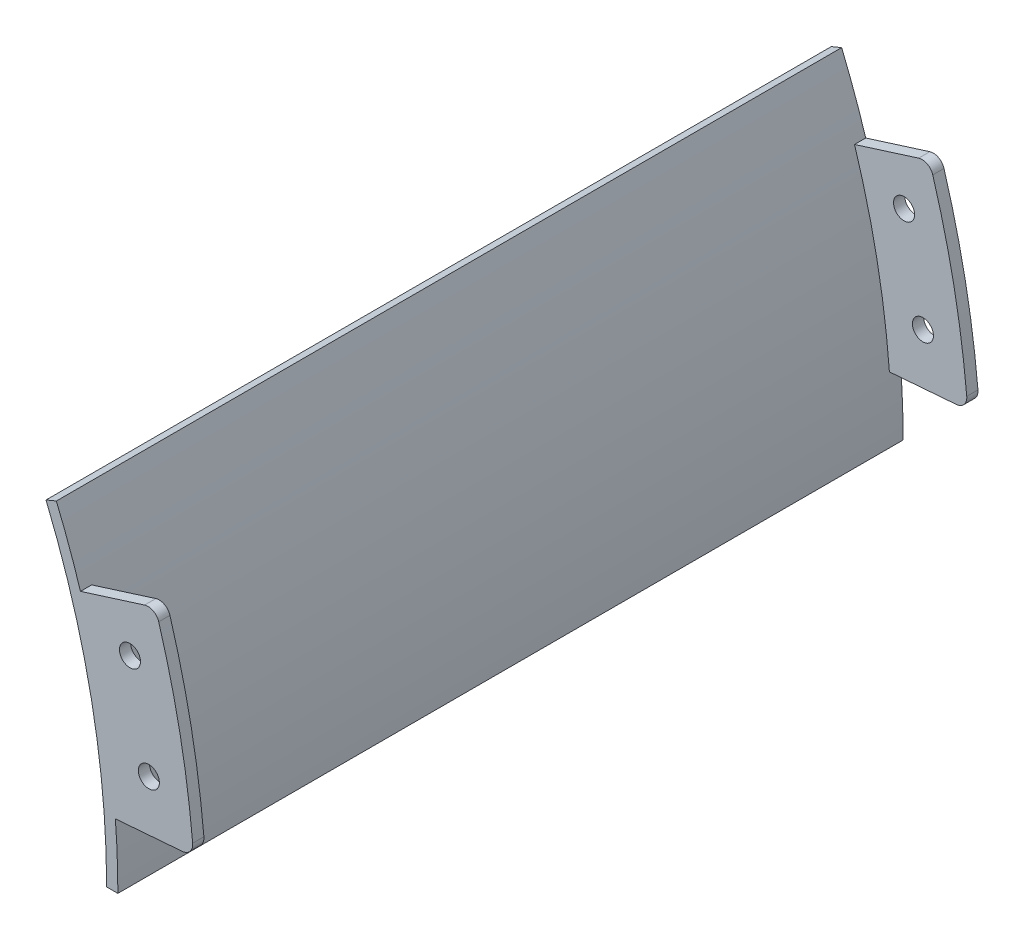
ISO-10303-21;
HEADER;
FILE_DESCRIPTION(('STEP AP214'),'2;1');
FILE_NAME('part.step','',(''),(''),'','','');
FILE_SCHEMA(('AUTOMOTIVE_DESIGN { 1 0 10303 214 1 1 1 1 }'));
ENDSEC;
DATA;
#1=APPLICATION_CONTEXT('core data for automotive mechanical design processes');
#2=APPLICATION_PROTOCOL_DEFINITION('international standard','automotive_design',2000,#1);
#3=PRODUCT_CONTEXT('',#1,'mechanical');
#4=PRODUCT('Part','Part','',(#3));
#5=PRODUCT_RELATED_PRODUCT_CATEGORY('part','',(#4));
#6=PRODUCT_DEFINITION_FORMATION('','',#4);
#7=PRODUCT_DEFINITION_CONTEXT('part definition',#1,'design');
#8=PRODUCT_DEFINITION('design','',#6,#7);
#9=PRODUCT_DEFINITION_SHAPE('','',#8);
#10=(LENGTH_UNIT() NAMED_UNIT(*) SI_UNIT(.MILLI.,.METRE.));
#11=(NAMED_UNIT(*) PLANE_ANGLE_UNIT() SI_UNIT($,.RADIAN.));
#12=(NAMED_UNIT(*) SI_UNIT($,.STERADIAN.) SOLID_ANGLE_UNIT());
#13=UNCERTAINTY_MEASURE_WITH_UNIT(LENGTH_MEASURE(1.E-05),#10,'distance_accuracy_value','');
#14=(GEOMETRIC_REPRESENTATION_CONTEXT(3) GLOBAL_UNCERTAINTY_ASSIGNED_CONTEXT((#13)) GLOBAL_UNIT_ASSIGNED_CONTEXT((#10,
#11,#12)) REPRESENTATION_CONTEXT('',''));
#15=CARTESIAN_POINT('',(0.,0.,0.));
#16=DIRECTION('',(0.,0.,1.));
#17=DIRECTION('',(1.,0.,0.));
#18=AXIS2_PLACEMENT_3D('',#15,#16,#17);
#19=CARTESIAN_POINT('',(0.,0.,177.8));
#20=DIRECTION('',(0.,0.,-1.));
#21=DIRECTION('',(-1.,0.,0.));
#22=AXIS2_PLACEMENT_3D('',#19,#20,#21);
#23=CYLINDRICAL_SURFACE('',#22,182.88);
#24=DIRECTION('',(0.,0.,-1.));
#25=VECTOR('',#24,1.);
#26=CARTESIAN_POINT('',(182.316241993114,14.3485994267075,2.54));
#27=LINE('',#26,#25);
#28=CARTESIAN_POINT('',(182.316241993114,14.3485994267075,2.53999999999999));
#29=VERTEX_POINT('',#28);
#30=CARTESIAN_POINT('',(182.316241993114,14.3485994267075,0.));
#31=VERTEX_POINT('',#30);
#32=EDGE_CURVE('E61',#29,#31,#27,.T.);
#33=ORIENTED_EDGE('',*,*,#32,.F.);
#34=CARTESIAN_POINT('',(0.,0.,2.54));
#35=DIRECTION('',(0.,0.,-1.));
#36=DIRECTION('',(-1.,0.,0.));
#37=AXIS2_PLACEMENT_3D('',#34,#35,#36);
#38=CIRCLE('',#37,182.88);
#39=CARTESIAN_POINT('',(174.415755952836,54.9930766133408,2.53999999999999));
#40=VERTEX_POINT('',#39);
#41=EDGE_CURVE('E66',#40,#29,#38,.T.);
#42=ORIENTED_EDGE('',*,*,#41,.F.);
#43=DIRECTION('',(0.,0.,-1.));
#44=VECTOR('',#43,1.);
#45=CARTESIAN_POINT('',(174.415755952836,54.9930766133408,2.54));
#46=LINE('',#45,#44);
#47=CARTESIAN_POINT('',(174.415755952836,54.9930766133408,0.));
#48=VERTEX_POINT('',#47);
#49=EDGE_CURVE('E182',#40,#48,#46,.T.);
#50=ORIENTED_EDGE('',*,*,#49,.T.);
#51=CARTESIAN_POINT('',(0.,0.,0.));
#52=DIRECTION('',(0.,0.,1.));
#53=DIRECTION('',(-1.,0.,0.));
#54=AXIS2_PLACEMENT_3D('',#51,#52,#53);
#55=CIRCLE('',#54,182.88);
#56=CARTESIAN_POINT('',(168.959088905665,69.9851461109266,0.));
#57=VERTEX_POINT('',#56);
#58=EDGE_CURVE('E331',#48,#57,#55,.T.);
#59=ORIENTED_EDGE('',*,*,#58,.T.);
#60=DIRECTION('',(0.,0.,-1.));
#61=VECTOR('',#60,1.);
#62=CARTESIAN_POINT('',(168.959088905665,69.9851461109266,177.8));
#63=LINE('',#62,#61);
#64=CARTESIAN_POINT('',(168.959088905665,69.9851461109266,177.8));
#65=VERTEX_POINT('',#64);
#66=EDGE_CURVE('E340',#65,#57,#63,.T.);
#67=ORIENTED_EDGE('',*,*,#66,.F.);
#68=CARTESIAN_POINT('',(0.,0.,177.8));
#69=DIRECTION('',(0.,0.,1.));
#70=DIRECTION('',(-1.,0.,0.));
#71=AXIS2_PLACEMENT_3D('',#68,#69,#70);
#72=CIRCLE('',#71,182.88);
#73=CARTESIAN_POINT('',(174.415755952836,54.9930766133408,177.8));
#74=VERTEX_POINT('',#73);
#75=EDGE_CURVE('E316',#74,#65,#72,.T.);
#76=ORIENTED_EDGE('',*,*,#75,.F.);
#77=DIRECTION('',(0.,0.,1.));
#78=VECTOR('',#77,1.);
#79=CARTESIAN_POINT('',(174.415755952836,54.9930766133408,175.26));
#80=LINE('',#79,#78);
#81=CARTESIAN_POINT('',(174.415755952836,54.9930766133408,175.26));
#82=VERTEX_POINT('',#81);
#83=EDGE_CURVE('E288',#82,#74,#80,.T.);
#84=ORIENTED_EDGE('',*,*,#83,.F.);
#85=CARTESIAN_POINT('',(0.,0.,175.26));
#86=DIRECTION('',(0.,0.,-1.));
#87=DIRECTION('',(-1.,0.,0.));
#88=AXIS2_PLACEMENT_3D('',#85,#86,#87);
#89=CIRCLE('',#88,182.88);
#90=CARTESIAN_POINT('',(182.316241993114,14.3485994267075,175.26));
#91=VERTEX_POINT('',#90);
#92=EDGE_CURVE('E245',#82,#91,#89,.T.);
#93=ORIENTED_EDGE('',*,*,#92,.T.);
#94=DIRECTION('',(0.,0.,1.));
#95=VECTOR('',#94,1.);
#96=CARTESIAN_POINT('',(182.316241993114,14.3485994267075,175.26));
#97=LINE('',#96,#95);
#98=CARTESIAN_POINT('',(182.316241993114,14.3485994267075,177.8));
#99=VERTEX_POINT('',#98);
#100=EDGE_CURVE('E270',#91,#99,#97,.T.);
#101=ORIENTED_EDGE('',*,*,#100,.T.);
#102=CARTESIAN_POINT('',(182.88,0.,177.8));
#103=VERTEX_POINT('',#102);
#104=EDGE_CURVE('E317',#103,#99,#72,.T.);
#105=ORIENTED_EDGE('',*,*,#104,.F.);
#106=DIRECTION('',(0.,0.,-1.));
#107=VECTOR('',#106,1.);
#108=CARTESIAN_POINT('',(182.88,0.,177.8));
#109=LINE('',#108,#107);
#110=CARTESIAN_POINT('',(182.88,0.,0.));
#111=VERTEX_POINT('',#110);
#112=EDGE_CURVE('E54',#103,#111,#109,.T.);
#113=ORIENTED_EDGE('',*,*,#112,.T.);
#114=EDGE_CURVE('E332',#111,#31,#55,.T.);
#115=ORIENTED_EDGE('',*,*,#114,.T.);
#116=EDGE_LOOP('',(#33,#42,#50,#59,#67,#76,#84,#93,#101,#105,#113,#115));
#117=FACE_BOUND('',#116,.T.);
#118=ADVANCED_FACE('F45',(#117),#23,.T.);
#119=CARTESIAN_POINT('',(0.,0.,177.8));
#120=DIRECTION('',(0.,0.,-1.));
#121=DIRECTION('',(-1.,0.,0.));
#122=AXIS2_PLACEMENT_3D('',#119,#120,#121);
#123=CYLINDRICAL_SURFACE('',#122,180.34);
#124=CARTESIAN_POINT('',(0.,0.,0.));
#125=DIRECTION('',(0.,0.,-1.));
#126=DIRECTION('',(-1.,0.,0.));
#127=AXIS2_PLACEMENT_3D('',#124,#125,#126);
#128=CIRCLE('',#127,180.34);
#129=CARTESIAN_POINT('',(166.612434893086,69.0131301927193,0.));
#130=VERTEX_POINT('',#129);
#131=CARTESIAN_POINT('',(180.34,0.,0.));
#132=VERTEX_POINT('',#131);
#133=EDGE_CURVE('E292',#130,#132,#128,.T.);
#134=ORIENTED_EDGE('',*,*,#133,.T.);
#135=DIRECTION('',(0.,0.,-1.));
#136=VECTOR('',#135,1.);
#137=CARTESIAN_POINT('',(180.34,0.,177.8));
#138=LINE('',#137,#136);
#139=CARTESIAN_POINT('',(180.34,0.,177.8));
#140=VERTEX_POINT('',#139);
#141=EDGE_CURVE('E11',#140,#132,#138,.T.);
#142=ORIENTED_EDGE('',*,*,#141,.F.);
#143=CARTESIAN_POINT('',(0.,0.,177.8));
#144=DIRECTION('',(0.,0.,-1.));
#145=DIRECTION('',(-1.,0.,0.));
#146=AXIS2_PLACEMENT_3D('',#143,#144,#145);
#147=CIRCLE('',#146,180.34);
#148=CARTESIAN_POINT('',(166.612434893086,69.0131301927193,177.8));
#149=VERTEX_POINT('',#148);
#150=EDGE_CURVE('E308',#149,#140,#147,.T.);
#151=ORIENTED_EDGE('',*,*,#150,.F.);
#152=DIRECTION('',(0.,0.,-1.));
#153=VECTOR('',#152,1.);
#154=CARTESIAN_POINT('',(166.612434893086,69.0131301927193,177.8));
#155=LINE('',#154,#153);
#156=EDGE_CURVE('E324',#149,#130,#155,.T.);
#157=ORIENTED_EDGE('',*,*,#156,.T.);
#158=EDGE_LOOP('',(#134,#142,#151,#157));
#159=FACE_BOUND('',#158,.T.);
#160=ADVANCED_FACE('F47',(#159),#123,.F.);
#161=CARTESIAN_POINT('',(182.88,0.,177.8));
#162=DIRECTION('',(0.,1.,0.));
#163=DIRECTION('',(-1.,0.,0.));
#164=AXIS2_PLACEMENT_3D('',#161,#162,#163);
#165=PLANE('',#164);
#166=DIRECTION('',(1.,0.,0.));
#167=VECTOR('',#166,1.);
#168=CARTESIAN_POINT('',(182.88,0.,0.));
#169=LINE('',#168,#167);
#170=EDGE_CURVE('E328',#132,#111,#169,.T.);
#171=ORIENTED_EDGE('',*,*,#170,.T.);
#172=ORIENTED_EDGE('',*,*,#112,.F.);
#173=DIRECTION('',(1.,0.,0.));
#174=VECTOR('',#173,1.);
#175=CARTESIAN_POINT('',(182.88,0.,177.8));
#176=LINE('',#175,#174);
#177=EDGE_CURVE('E312',#140,#103,#176,.T.);
#178=ORIENTED_EDGE('',*,*,#177,.F.);
#179=ORIENTED_EDGE('',*,*,#141,.T.);
#180=EDGE_LOOP('',(#171,#172,#178,#179));
#181=FACE_BOUND('',#180,.T.);
#182=ADVANCED_FACE('F382',(#181),#165,.F.);
#183=CARTESIAN_POINT('',(166.612434893086,69.0131301927193,177.8));
#184=DIRECTION('',(0.38268343236508,-0.923879532511291,0.));
#185=DIRECTION('',(0.923879532511291,0.38268343236508,0.));
#186=AXIS2_PLACEMENT_3D('',#183,#184,#185);
#187=PLANE('',#186);
#188=DIRECTION('',(-0.923879532511291,-0.38268343236508,0.));
#189=VECTOR('',#188,1.);
#190=CARTESIAN_POINT('',(166.612434893086,69.0131301927193,0.));
#191=LINE('',#190,#189);
#192=EDGE_CURVE('E313',#57,#130,#191,.T.);
#193=ORIENTED_EDGE('',*,*,#192,.T.);
#194=ORIENTED_EDGE('',*,*,#156,.F.);
#195=DIRECTION('',(-0.923879532511291,-0.38268343236508,0.));
#196=VECTOR('',#195,1.);
#197=CARTESIAN_POINT('',(166.612434893086,69.0131301927193,177.8));
#198=LINE('',#197,#196);
#199=EDGE_CURVE('E321',#65,#149,#198,.T.);
#200=ORIENTED_EDGE('',*,*,#199,.F.);
#201=ORIENTED_EDGE('',*,*,#66,.T.);
#202=EDGE_LOOP('',(#193,#194,#200,#201));
#203=FACE_BOUND('',#202,.T.);
#204=ADVANCED_FACE('F378',(#203),#187,.F.);
#205=CARTESIAN_POINT('',(0.,0.,177.8));
#206=DIRECTION('',(0.,0.,-1.));
#207=DIRECTION('',(-1.,0.,0.));
#208=AXIS2_PLACEMENT_3D('',#205,#206,#207);
#209=PLANE('',#208);
#210=ORIENTED_EDGE('',*,*,#150,.T.);
#211=ORIENTED_EDGE('',*,*,#177,.T.);
#212=ORIENTED_EDGE('',*,*,#104,.T.);
#213=DIRECTION('',(0.996917333733128,0.0784590957278403,0.));
#214=VECTOR('',#213,1.);
#215=CARTESIAN_POINT('',(197.493029633011,15.5430385180821,177.8));
#216=LINE('',#215,#214);
#217=CARTESIAN_POINT('',(197.493029633011,15.5430385180821,177.8));
#218=VERTEX_POINT('',#217);
#219=EDGE_CURVE('E241',#99,#218,#216,.T.);
#220=ORIENTED_EDGE('',*,*,#219,.T.);
#221=CARTESIAN_POINT('',(197.293743529862,18.0752085457642,177.8));
#222=DIRECTION('',(0.,0.,1.));
#223=DIRECTION('',(-1.,0.,0.));
#224=AXIS2_PLACEMENT_3D('',#221,#222,#223);
#225=CIRCLE('',#224,2.54);
#226=CARTESIAN_POINT('',(199.823150498194,18.3069419886586,177.8));
#227=VERTEX_POINT('',#226);
#228=EDGE_CURVE('E274',#218,#227,#225,.T.);
#229=ORIENTED_EDGE('',*,*,#228,.T.);
#230=CARTESIAN_POINT('',(0.,0.,177.8));
#231=DIRECTION('',(0.,0.,1.));
#232=DIRECTION('',(-1.,0.,0.));
#233=AXIS2_PLACEMENT_3D('',#230,#231,#232);
#234=CIRCLE('',#233,200.66);
#235=CARTESIAN_POINT('',(192.130700084829,57.8811686553869,177.8));
#236=VERTEX_POINT('',#235);
#237=EDGE_CURVE('E278',#227,#236,#234,.T.);
#238=ORIENTED_EDGE('',*,*,#237,.T.);
#239=CARTESIAN_POINT('',(189.69866590654,57.1484956344327,177.8));
#240=DIRECTION('',(0.,0.,1.));
#241=DIRECTION('',(-1.,0.,0.));
#242=AXIS2_PLACEMENT_3D('',#239,#240,#241);
#243=CIRCLE('',#242,2.54000000000002);
#244=CARTESIAN_POINT('',(188.9348731758,59.5709366893332,177.8));
#245=VERTEX_POINT('',#244);
#246=EDGE_CURVE('E282',#236,#245,#243,.T.);
#247=ORIENTED_EDGE('',*,*,#246,.T.);
#248=DIRECTION('',(-0.953716950748228,-0.300705799504268,0.));
#249=VECTOR('',#248,1.);
#250=CARTESIAN_POINT('',(174.415755952836,54.9930766133408,177.8));
#251=LINE('',#250,#249);
#252=EDGE_CURVE('E250',#245,#74,#251,.T.);
#253=ORIENTED_EDGE('',*,*,#252,.T.);
#254=ORIENTED_EDGE('',*,*,#75,.T.);
#255=ORIENTED_EDGE('',*,*,#199,.T.);
#256=EDGE_LOOP('',(#210,#211,#212,#220,#229,#238,#247,#253,#254,#255));
#257=FACE_BOUND('',#256,.T.);
#258=CARTESIAN_POINT('',(189.904635813063,26.4111628010535,177.8));
#259=DIRECTION('',(0.,0.,1.));
#260=DIRECTION('',(1.,0.,0.));
#261=AXIS2_PLACEMENT_3D('',#258,#259,#260);
#262=CIRCLE('',#261,2.38125000000001);
#263=CARTESIAN_POINT('',(192.285885813063,26.4111628010535,177.8));
#264=VERTEX_POINT('',#263);
#265=EDGE_CURVE('E216',#264,#264,#262,.T.);
#266=ORIENTED_EDGE('',*,*,#265,.F.);
#267=EDGE_LOOP('',(#266));
#268=FACE_BOUND('',#267,.T.);
#269=CARTESIAN_POINT('',(185.626529875292,48.0011628010535,177.8));
#270=DIRECTION('',(0.,0.,1.));
#271=DIRECTION('',(1.,0.,0.));
#272=AXIS2_PLACEMENT_3D('',#269,#270,#271);
#273=CIRCLE('',#272,2.38125);
#274=CARTESIAN_POINT('',(188.007779875292,48.0011628010535,177.8));
#275=VERTEX_POINT('',#274);
#276=EDGE_CURVE('E233',#275,#275,#273,.T.);
#277=ORIENTED_EDGE('',*,*,#276,.F.);
#278=EDGE_LOOP('',(#277));
#279=FACE_BOUND('',#278,.T.);
#280=ADVANCED_FACE('F371',(#257,#268,#279),#209,.F.);
#281=CARTESIAN_POINT('',(0.,0.,0.));
#282=DIRECTION('',(0.,0.,-1.));
#283=DIRECTION('',(-1.,0.,0.));
#284=AXIS2_PLACEMENT_3D('',#281,#282,#283);
#285=PLANE('',#284);
#286=ORIENTED_EDGE('',*,*,#133,.F.);
#287=ORIENTED_EDGE('',*,*,#192,.F.);
#288=ORIENTED_EDGE('',*,*,#58,.F.);
#289=DIRECTION('',(-0.953716950748228,-0.300705799504268,0.));
#290=VECTOR('',#289,1.);
#291=CARTESIAN_POINT('',(174.415755952836,54.9930766133408,0.));
#292=LINE('',#291,#290);
#293=CARTESIAN_POINT('',(188.9348731758,59.5709366893332,0.));
#294=VERTEX_POINT('',#293);
#295=EDGE_CURVE('E200',#294,#48,#292,.T.);
#296=ORIENTED_EDGE('',*,*,#295,.F.);
#297=CARTESIAN_POINT('',(189.69866590654,57.1484956344327,0.));
#298=DIRECTION('',(0.,0.,1.));
#299=DIRECTION('',(-1.,0.,0.));
#300=AXIS2_PLACEMENT_3D('',#297,#298,#299);
#301=CIRCLE('',#300,2.54000000000002);
#302=CARTESIAN_POINT('',(192.130700084829,57.8811686553869,0.));
#303=VERTEX_POINT('',#302);
#304=EDGE_CURVE('E176',#303,#294,#301,.T.);
#305=ORIENTED_EDGE('',*,*,#304,.F.);
#306=CARTESIAN_POINT('',(0.,0.,0.));
#307=DIRECTION('',(0.,0.,1.));
#308=DIRECTION('',(-1.,0.,0.));
#309=AXIS2_PLACEMENT_3D('',#306,#307,#308);
#310=CIRCLE('',#309,200.66);
#311=CARTESIAN_POINT('',(199.823150498194,18.3069419886586,0.));
#312=VERTEX_POINT('',#311);
#313=EDGE_CURVE('E206',#312,#303,#310,.T.);
#314=ORIENTED_EDGE('',*,*,#313,.F.);
#315=CARTESIAN_POINT('',(197.293743529862,18.0752085457642,0.));
#316=DIRECTION('',(0.,0.,1.));
#317=DIRECTION('',(-1.,0.,0.));
#318=AXIS2_PLACEMENT_3D('',#315,#316,#317);
#319=CIRCLE('',#318,2.54);
#320=CARTESIAN_POINT('',(197.493029633011,15.5430385180821,0.));
#321=VERTEX_POINT('',#320);
#322=EDGE_CURVE('E209',#321,#312,#319,.T.);
#323=ORIENTED_EDGE('',*,*,#322,.F.);
#324=DIRECTION('',(0.996917333733128,0.0784590957278403,0.));
#325=VECTOR('',#324,1.);
#326=CARTESIAN_POINT('',(197.493029633011,15.5430385180821,0.));
#327=LINE('',#326,#325);
#328=EDGE_CURVE('E188',#31,#321,#327,.T.);
#329=ORIENTED_EDGE('',*,*,#328,.F.);
#330=ORIENTED_EDGE('',*,*,#114,.F.);
#331=ORIENTED_EDGE('',*,*,#170,.F.);
#332=EDGE_LOOP('',(#286,#287,#288,#296,#305,#314,#323,#329,#330,#331));
#333=FACE_BOUND('',#332,.T.);
#334=CARTESIAN_POINT('',(185.626529875292,48.0011628010535,0.));
#335=DIRECTION('',(0.,0.,1.));
#336=DIRECTION('',(1.,0.,0.));
#337=AXIS2_PLACEMENT_3D('',#334,#335,#336);
#338=CIRCLE('',#337,2.38125);
#339=CARTESIAN_POINT('',(188.007779875292,48.0011628010535,0.));
#340=VERTEX_POINT('',#339);
#341=EDGE_CURVE('E463',#340,#340,#338,.T.);
#342=ORIENTED_EDGE('',*,*,#341,.T.);
#343=EDGE_LOOP('',(#342));
#344=FACE_BOUND('',#343,.T.);
#345=CARTESIAN_POINT('',(189.904635813063,26.4111628010535,0.));
#346=DIRECTION('',(0.,0.,1.));
#347=DIRECTION('',(1.,0.,0.));
#348=AXIS2_PLACEMENT_3D('',#345,#346,#347);
#349=CIRCLE('',#348,2.38125000000001);
#350=CARTESIAN_POINT('',(192.285885813063,26.4111628010535,0.));
#351=VERTEX_POINT('',#350);
#352=EDGE_CURVE('E458',#351,#351,#349,.T.);
#353=ORIENTED_EDGE('',*,*,#352,.T.);
#354=EDGE_LOOP('',(#353));
#355=FACE_BOUND('',#354,.T.);
#356=ADVANCED_FACE('F352',(#333,#344,#355),#285,.T.);
#357=CARTESIAN_POINT('',(174.415755952836,54.9930766133408,175.26));
#358=DIRECTION('',(-0.300705799504268,0.953716950748228,0.));
#359=DIRECTION('',(-0.953716950748228,-0.300705799504268,0.));
#360=AXIS2_PLACEMENT_3D('',#357,#358,#359);
#361=PLANE('',#360);
#362=ORIENTED_EDGE('',*,*,#252,.F.);
#363=DIRECTION('',(0.,0.,1.));
#364=VECTOR('',#363,1.);
#365=CARTESIAN_POINT('',(188.9348731758,59.5709366893332,175.26));
#366=LINE('',#365,#364);
#367=CARTESIAN_POINT('',(188.9348731758,59.5709366893332,175.26));
#368=VERTEX_POINT('',#367);
#369=EDGE_CURVE('E293',#368,#245,#366,.T.);
#370=ORIENTED_EDGE('',*,*,#369,.F.);
#371=DIRECTION('',(-0.953716950748228,-0.300705799504268,0.));
#372=VECTOR('',#371,1.);
#373=CARTESIAN_POINT('',(174.415755952836,54.9930766133408,175.26));
#374=LINE('',#373,#372);
#375=EDGE_CURVE('E266',#368,#82,#374,.T.);
#376=ORIENTED_EDGE('',*,*,#375,.T.);
#377=ORIENTED_EDGE('',*,*,#83,.T.);
#378=EDGE_LOOP('',(#362,#370,#376,#377));
#379=FACE_BOUND('',#378,.T.);
#380=ADVANCED_FACE('F397',(#379),#361,.T.);
#381=CARTESIAN_POINT('',(189.69866590654,57.1484956344327,175.26));
#382=DIRECTION('',(0.,0.,1.));
#383=DIRECTION('',(1.,0.,0.));
#384=AXIS2_PLACEMENT_3D('',#381,#382,#383);
#385=CYLINDRICAL_SURFACE('',#384,2.54000000000002);
#386=ORIENTED_EDGE('',*,*,#246,.F.);
#387=DIRECTION('',(0.,0.,1.));
#388=VECTOR('',#387,1.);
#389=CARTESIAN_POINT('',(192.130700084829,57.8811686553869,175.26));
#390=LINE('',#389,#388);
#391=CARTESIAN_POINT('',(192.130700084829,57.8811686553869,175.26));
#392=VERTEX_POINT('',#391);
#393=EDGE_CURVE('E296',#392,#236,#390,.T.);
#394=ORIENTED_EDGE('',*,*,#393,.F.);
#395=CARTESIAN_POINT('',(189.69866590654,57.1484956344327,175.26));
#396=DIRECTION('',(0.,0.,1.));
#397=DIRECTION('',(-1.,0.,0.));
#398=AXIS2_PLACEMENT_3D('',#395,#396,#397);
#399=CIRCLE('',#398,2.54000000000002);
#400=EDGE_CURVE('E262',#392,#368,#399,.T.);
#401=ORIENTED_EDGE('',*,*,#400,.T.);
#402=ORIENTED_EDGE('',*,*,#369,.T.);
#403=EDGE_LOOP('',(#386,#394,#401,#402));
#404=FACE_BOUND('',#403,.T.);
#405=ADVANCED_FACE('F412',(#404),#385,.T.);
#406=CARTESIAN_POINT('',(0.,0.,175.26));
#407=DIRECTION('',(0.,0.,1.));
#408=DIRECTION('',(1.,0.,0.));
#409=AXIS2_PLACEMENT_3D('',#406,#407,#408);
#410=CYLINDRICAL_SURFACE('',#409,200.66);
#411=ORIENTED_EDGE('',*,*,#237,.F.);
#412=DIRECTION('',(0.,0.,1.));
#413=VECTOR('',#412,1.);
#414=CARTESIAN_POINT('',(199.823150498194,18.3069419886586,175.26));
#415=LINE('',#414,#413);
#416=CARTESIAN_POINT('',(199.823150498194,18.3069419886586,175.26));
#417=VERTEX_POINT('',#416);
#418=EDGE_CURVE('E299',#417,#227,#415,.T.);
#419=ORIENTED_EDGE('',*,*,#418,.F.);
#420=CARTESIAN_POINT('',(0.,0.,175.26));
#421=DIRECTION('',(0.,0.,1.));
#422=DIRECTION('',(-1.,0.,0.));
#423=AXIS2_PLACEMENT_3D('',#420,#421,#422);
#424=CIRCLE('',#423,200.66);
#425=EDGE_CURVE('E258',#417,#392,#424,.T.);
#426=ORIENTED_EDGE('',*,*,#425,.T.);
#427=ORIENTED_EDGE('',*,*,#393,.T.);
#428=EDGE_LOOP('',(#411,#419,#426,#427));
#429=FACE_BOUND('',#428,.T.);
#430=ADVANCED_FACE('F408',(#429),#410,.T.);
#431=CARTESIAN_POINT('',(197.293743529862,18.0752085457642,175.26));
#432=DIRECTION('',(0.,0.,1.));
#433=DIRECTION('',(1.,0.,0.));
#434=AXIS2_PLACEMENT_3D('',#431,#432,#433);
#435=CYLINDRICAL_SURFACE('',#434,2.54);
#436=ORIENTED_EDGE('',*,*,#228,.F.);
#437=DIRECTION('',(0.,0.,1.));
#438=VECTOR('',#437,1.);
#439=CARTESIAN_POINT('',(197.493029633011,15.5430385180821,175.26));
#440=LINE('',#439,#438);
#441=CARTESIAN_POINT('',(197.493029633011,15.5430385180821,175.26));
#442=VERTEX_POINT('',#441);
#443=EDGE_CURVE('E302',#442,#218,#440,.T.);
#444=ORIENTED_EDGE('',*,*,#443,.F.);
#445=CARTESIAN_POINT('',(197.293743529862,18.0752085457642,175.26));
#446=DIRECTION('',(0.,0.,1.));
#447=DIRECTION('',(-1.,0.,0.));
#448=AXIS2_PLACEMENT_3D('',#445,#446,#447);
#449=CIRCLE('',#448,2.54);
#450=EDGE_CURVE('E254',#442,#417,#449,.T.);
#451=ORIENTED_EDGE('',*,*,#450,.T.);
#452=ORIENTED_EDGE('',*,*,#418,.T.);
#453=EDGE_LOOP('',(#436,#444,#451,#452));
#454=FACE_BOUND('',#453,.T.);
#455=ADVANCED_FACE('F404',(#454),#435,.T.);
#456=CARTESIAN_POINT('',(197.493029633011,15.5430385180821,175.26));
#457=DIRECTION('',(0.0784590957278403,-0.996917333733129,0.));
#458=DIRECTION('',(0.996917333733128,0.0784590957278403,0.));
#459=AXIS2_PLACEMENT_3D('',#456,#457,#458);
#460=PLANE('',#459);
#461=ORIENTED_EDGE('',*,*,#219,.F.);
#462=ORIENTED_EDGE('',*,*,#100,.F.);
#463=DIRECTION('',(0.996917333733128,0.0784590957278403,0.));
#464=VECTOR('',#463,1.);
#465=CARTESIAN_POINT('',(197.493029633011,15.5430385180821,175.26));
#466=LINE('',#465,#464);
#467=EDGE_CURVE('E249',#91,#442,#466,.T.);
#468=ORIENTED_EDGE('',*,*,#467,.T.);
#469=ORIENTED_EDGE('',*,*,#443,.T.);
#470=EDGE_LOOP('',(#461,#462,#468,#469));
#471=FACE_BOUND('',#470,.T.);
#472=ADVANCED_FACE('F400',(#471),#460,.T.);
#473=CARTESIAN_POINT('',(0.,0.,175.26));
#474=DIRECTION('',(0.,0.,-1.));
#475=DIRECTION('',(-1.,0.,0.));
#476=AXIS2_PLACEMENT_3D('',#473,#474,#475);
#477=PLANE('',#476);
#478=CARTESIAN_POINT('',(189.904635813063,26.4111628010535,175.26));
#479=DIRECTION('',(0.,0.,1.));
#480=DIRECTION('',(1.,0.,0.));
#481=AXIS2_PLACEMENT_3D('',#478,#479,#480);
#482=CIRCLE('',#481,2.38125000000001);
#483=CARTESIAN_POINT('',(192.285885813063,26.4111628010535,175.26));
#484=VERTEX_POINT('',#483);
#485=EDGE_CURVE('E229',#484,#484,#482,.T.);
#486=ORIENTED_EDGE('',*,*,#485,.T.);
#487=EDGE_LOOP('',(#486));
#488=FACE_BOUND('',#487,.T.);
#489=CARTESIAN_POINT('',(185.626529875292,48.0011628010535,175.26));
#490=DIRECTION('',(0.,0.,1.));
#491=DIRECTION('',(1.,0.,0.));
#492=AXIS2_PLACEMENT_3D('',#489,#490,#491);
#493=CIRCLE('',#492,2.38125);
#494=CARTESIAN_POINT('',(188.007779875292,48.0011628010535,175.26));
#495=VERTEX_POINT('',#494);
#496=EDGE_CURVE('E237',#495,#495,#493,.T.);
#497=ORIENTED_EDGE('',*,*,#496,.T.);
#498=EDGE_LOOP('',(#497));
#499=FACE_BOUND('',#498,.T.);
#500=ORIENTED_EDGE('',*,*,#92,.F.);
#501=ORIENTED_EDGE('',*,*,#375,.F.);
#502=ORIENTED_EDGE('',*,*,#400,.F.);
#503=ORIENTED_EDGE('',*,*,#425,.F.);
#504=ORIENTED_EDGE('',*,*,#450,.F.);
#505=ORIENTED_EDGE('',*,*,#467,.F.);
#506=EDGE_LOOP('',(#500,#501,#502,#503,#504,#505));
#507=FACE_BOUND('',#506,.T.);
#508=ADVANCED_FACE('F403',(#488,#499,#507),#477,.T.);
#509=CARTESIAN_POINT('',(185.626529875292,48.0011628010535,175.26));
#510=DIRECTION('',(0.,0.,1.));
#511=DIRECTION('',(1.,0.,0.));
#512=AXIS2_PLACEMENT_3D('',#509,#510,#511);
#513=CYLINDRICAL_SURFACE('',#512,2.38125);
#514=ORIENTED_EDGE('',*,*,#496,.F.);
#515=EDGE_LOOP('',(#514));
#516=FACE_BOUND('',#515,.T.);
#517=ORIENTED_EDGE('',*,*,#276,.T.);
#518=EDGE_LOOP('',(#517));
#519=FACE_BOUND('',#518,.T.);
#520=ADVANCED_FACE('F422',(#516,#519),#513,.F.);
#521=CARTESIAN_POINT('',(189.904635813063,26.4111628010535,175.26));
#522=DIRECTION('',(0.,0.,1.));
#523=DIRECTION('',(1.,0.,0.));
#524=AXIS2_PLACEMENT_3D('',#521,#522,#523);
#525=CYLINDRICAL_SURFACE('',#524,2.38125000000001);
#526=ORIENTED_EDGE('',*,*,#485,.F.);
#527=EDGE_LOOP('',(#526));
#528=FACE_BOUND('',#527,.T.);
#529=ORIENTED_EDGE('',*,*,#265,.T.);
#530=EDGE_LOOP('',(#529));
#531=FACE_BOUND('',#530,.T.);
#532=ADVANCED_FACE('F426',(#528,#531),#525,.F.);
#533=CARTESIAN_POINT('',(0.,0.,2.54));
#534=DIRECTION('',(0.,0.,1.));
#535=DIRECTION('',(-1.,0.,0.));
#536=AXIS2_PLACEMENT_3D('',#533,#534,#535);
#537=PLANE('',#536);
#538=CARTESIAN_POINT('',(185.626529875292,48.0011628010535,2.54));
#539=DIRECTION('',(0.,0.,1.));
#540=DIRECTION('',(1.,0.,0.));
#541=AXIS2_PLACEMENT_3D('',#538,#539,#540);
#542=CIRCLE('',#541,2.38125);
#543=CARTESIAN_POINT('',(188.007779875292,48.0011628010535,2.54));
#544=VERTEX_POINT('',#543);
#545=EDGE_CURVE('E203',#544,#544,#542,.T.);
#546=ORIENTED_EDGE('',*,*,#545,.F.);
#547=EDGE_LOOP('',(#546));
#548=FACE_BOUND('',#547,.T.);
#549=ORIENTED_EDGE('',*,*,#41,.T.);
#550=DIRECTION('',(0.996917333733128,0.0784590957278403,0.));
#551=VECTOR('',#550,1.);
#552=CARTESIAN_POINT('',(197.493029633011,15.5430385180821,2.54));
#553=LINE('',#552,#551);
#554=CARTESIAN_POINT('',(197.493029633011,15.5430385180821,2.54));
#555=VERTEX_POINT('',#554);
#556=EDGE_CURVE('E197',#29,#555,#553,.T.);
#557=ORIENTED_EDGE('',*,*,#556,.T.);
#558=CARTESIAN_POINT('',(197.293743529862,18.0752085457642,2.54));
#559=DIRECTION('',(0.,0.,1.));
#560=DIRECTION('',(-1.,0.,0.));
#561=AXIS2_PLACEMENT_3D('',#558,#559,#560);
#562=CIRCLE('',#561,2.54);
#563=CARTESIAN_POINT('',(199.823150498194,18.3069419886586,2.54));
#564=VERTEX_POINT('',#563);
#565=EDGE_CURVE('E194',#555,#564,#562,.T.);
#566=ORIENTED_EDGE('',*,*,#565,.T.);
#567=CARTESIAN_POINT('',(0.,0.,2.54));
#568=DIRECTION('',(0.,0.,1.));
#569=DIRECTION('',(-1.,0.,0.));
#570=AXIS2_PLACEMENT_3D('',#567,#568,#569);
#571=CIRCLE('',#570,200.66);
#572=CARTESIAN_POINT('',(192.130700084829,57.8811686553869,2.54));
#573=VERTEX_POINT('',#572);
#574=EDGE_CURVE('E166',#564,#573,#571,.T.);
#575=ORIENTED_EDGE('',*,*,#574,.T.);
#576=CARTESIAN_POINT('',(189.69866590654,57.1484956344327,2.54));
#577=DIRECTION('',(0.,0.,1.));
#578=DIRECTION('',(-1.,0.,0.));
#579=AXIS2_PLACEMENT_3D('',#576,#577,#578);
#580=CIRCLE('',#579,2.54000000000002);
#581=CARTESIAN_POINT('',(188.9348731758,59.5709366893332,2.54));
#582=VERTEX_POINT('',#581);
#583=EDGE_CURVE('E158',#573,#582,#580,.T.);
#584=ORIENTED_EDGE('',*,*,#583,.T.);
#585=DIRECTION('',(-0.953716950748228,-0.300705799504268,0.));
#586=VECTOR('',#585,1.);
#587=CARTESIAN_POINT('',(174.415755952836,54.9930766133408,2.54));
#588=LINE('',#587,#586);
#589=EDGE_CURVE('E163',#582,#40,#588,.T.);
#590=ORIENTED_EDGE('',*,*,#589,.T.);
#591=EDGE_LOOP('',(#549,#557,#566,#575,#584,#590));
#592=FACE_BOUND('',#591,.T.);
#593=CARTESIAN_POINT('',(189.904635813063,26.4111628010535,2.54));
#594=DIRECTION('',(0.,0.,1.));
#595=DIRECTION('',(1.,0.,0.));
#596=AXIS2_PLACEMENT_3D('',#593,#594,#595);
#597=CIRCLE('',#596,2.38125000000001);
#598=CARTESIAN_POINT('',(192.285885813063,26.4111628010535,2.54));
#599=VERTEX_POINT('',#598);
#600=EDGE_CURVE('E455',#599,#599,#597,.T.);
#601=ORIENTED_EDGE('',*,*,#600,.F.);
#602=EDGE_LOOP('',(#601));
#603=FACE_BOUND('',#602,.T.);
#604=ADVANCED_FACE('F160',(#548,#592,#603),#537,.T.);
#605=CARTESIAN_POINT('',(197.493029633011,15.5430385180821,2.54));
#606=DIRECTION('',(-0.0784590957278403,0.996917333733129,0.));
#607=DIRECTION('',(-0.996917333733128,-0.0784590957278403,0.));
#608=AXIS2_PLACEMENT_3D('',#605,#606,#607);
#609=PLANE('',#608);
#610=ORIENTED_EDGE('',*,*,#328,.T.);
#611=DIRECTION('',(0.,0.,-1.));
#612=VECTOR('',#611,1.);
#613=CARTESIAN_POINT('',(197.493029633011,15.5430385180821,2.54));
#614=LINE('',#613,#612);
#615=EDGE_CURVE('E217',#555,#321,#614,.T.);
#616=ORIENTED_EDGE('',*,*,#615,.F.);
#617=ORIENTED_EDGE('',*,*,#556,.F.);
#618=ORIENTED_EDGE('',*,*,#32,.T.);
#619=EDGE_LOOP('',(#610,#616,#617,#618));
#620=FACE_BOUND('',#619,.T.);
#621=ADVANCED_FACE('F358',(#620),#609,.F.);
#622=CARTESIAN_POINT('',(197.293743529862,18.0752085457642,2.54));
#623=DIRECTION('',(0.,0.,-1.));
#624=DIRECTION('',(-1.,0.,0.));
#625=AXIS2_PLACEMENT_3D('',#622,#623,#624);
#626=CYLINDRICAL_SURFACE('',#625,2.54);
#627=ORIENTED_EDGE('',*,*,#322,.T.);
#628=DIRECTION('',(0.,0.,-1.));
#629=VECTOR('',#628,1.);
#630=CARTESIAN_POINT('',(199.823150498194,18.3069419886586,2.54));
#631=LINE('',#630,#629);
#632=EDGE_CURVE('E221',#564,#312,#631,.T.);
#633=ORIENTED_EDGE('',*,*,#632,.F.);
#634=ORIENTED_EDGE('',*,*,#565,.F.);
#635=ORIENTED_EDGE('',*,*,#615,.T.);
#636=EDGE_LOOP('',(#627,#633,#634,#635));
#637=FACE_BOUND('',#636,.T.);
#638=ADVANCED_FACE('F362',(#637),#626,.T.);
#639=CARTESIAN_POINT('',(0.,0.,2.54));
#640=DIRECTION('',(0.,0.,-1.));
#641=DIRECTION('',(-1.,0.,0.));
#642=AXIS2_PLACEMENT_3D('',#639,#640,#641);
#643=CYLINDRICAL_SURFACE('',#642,200.66);
#644=ORIENTED_EDGE('',*,*,#313,.T.);
#645=DIRECTION('',(0.,0.,-1.));
#646=VECTOR('',#645,1.);
#647=CARTESIAN_POINT('',(192.130700084829,57.8811686553869,2.54));
#648=LINE('',#647,#646);
#649=EDGE_CURVE('E181',#573,#303,#648,.T.);
#650=ORIENTED_EDGE('',*,*,#649,.F.);
#651=ORIENTED_EDGE('',*,*,#574,.F.);
#652=ORIENTED_EDGE('',*,*,#632,.T.);
#653=EDGE_LOOP('',(#644,#650,#651,#652));
#654=FACE_BOUND('',#653,.T.);
#655=ADVANCED_FACE('F364',(#654),#643,.T.);
#656=CARTESIAN_POINT('',(189.69866590654,57.1484956344327,2.54));
#657=DIRECTION('',(0.,0.,-1.));
#658=DIRECTION('',(-1.,0.,0.));
#659=AXIS2_PLACEMENT_3D('',#656,#657,#658);
#660=CYLINDRICAL_SURFACE('',#659,2.54000000000002);
#661=ORIENTED_EDGE('',*,*,#304,.T.);
#662=DIRECTION('',(0.,0.,-1.));
#663=VECTOR('',#662,1.);
#664=CARTESIAN_POINT('',(188.9348731758,59.5709366893332,2.54));
#665=LINE('',#664,#663);
#666=EDGE_CURVE('E173',#582,#294,#665,.T.);
#667=ORIENTED_EDGE('',*,*,#666,.F.);
#668=ORIENTED_EDGE('',*,*,#583,.F.);
#669=ORIENTED_EDGE('',*,*,#649,.T.);
#670=EDGE_LOOP('',(#661,#667,#668,#669));
#671=FACE_BOUND('',#670,.T.);
#672=ADVANCED_FACE('F174',(#671),#660,.T.);
#673=CARTESIAN_POINT('',(174.415755952836,54.9930766133408,2.54));
#674=DIRECTION('',(0.300705799504268,-0.953716950748228,0.));
#675=DIRECTION('',(0.953716950748228,0.300705799504268,0.));
#676=AXIS2_PLACEMENT_3D('',#673,#674,#675);
#677=PLANE('',#676);
#678=ORIENTED_EDGE('',*,*,#295,.T.);
#679=ORIENTED_EDGE('',*,*,#49,.F.);
#680=ORIENTED_EDGE('',*,*,#589,.F.);
#681=ORIENTED_EDGE('',*,*,#666,.T.);
#682=EDGE_LOOP('',(#678,#679,#680,#681));
#683=FACE_BOUND('',#682,.T.);
#684=ADVANCED_FACE('F184',(#683),#677,.F.);
#685=CARTESIAN_POINT('',(185.626529875292,48.0011628010535,2.54));
#686=DIRECTION('',(0.,0.,-1.));
#687=DIRECTION('',(-1.,0.,0.));
#688=AXIS2_PLACEMENT_3D('',#685,#686,#687);
#689=CYLINDRICAL_SURFACE('',#688,2.38125);
#690=ORIENTED_EDGE('',*,*,#545,.T.);
#691=EDGE_LOOP('',(#690));
#692=FACE_BOUND('',#691,.T.);
#693=ORIENTED_EDGE('',*,*,#341,.F.);
#694=EDGE_LOOP('',(#693));
#695=FACE_BOUND('',#694,.T.);
#696=ADVANCED_FACE('F432',(#692,#695),#689,.F.);
#697=CARTESIAN_POINT('',(189.904635813063,26.4111628010535,2.54));
#698=DIRECTION('',(0.,0.,-1.));
#699=DIRECTION('',(-1.,0.,0.));
#700=AXIS2_PLACEMENT_3D('',#697,#698,#699);
#701=CYLINDRICAL_SURFACE('',#700,2.38125000000001);
#702=ORIENTED_EDGE('',*,*,#600,.T.);
#703=EDGE_LOOP('',(#702));
#704=FACE_BOUND('',#703,.T.);
#705=ORIENTED_EDGE('',*,*,#352,.F.);
#706=EDGE_LOOP('',(#705));
#707=FACE_BOUND('',#706,.T.);
#708=ADVANCED_FACE('F446',(#704,#707),#701,.F.);
#709=CLOSED_SHELL('',(#118,#160,#182,#204,#280,#356,#380,#405,#430,#455,#472,#508,#520,#532,
#604,#621,#638,#655,#672,#684,#696,#708));
#710=MANIFOLD_SOLID_BREP('B2',#709);
#711=ADVANCED_BREP_SHAPE_REPRESENTATION('',(#18,#710),#14);
#712=SHAPE_DEFINITION_REPRESENTATION(#9,#711);
ENDSEC;
END-ISO-10303-21;
